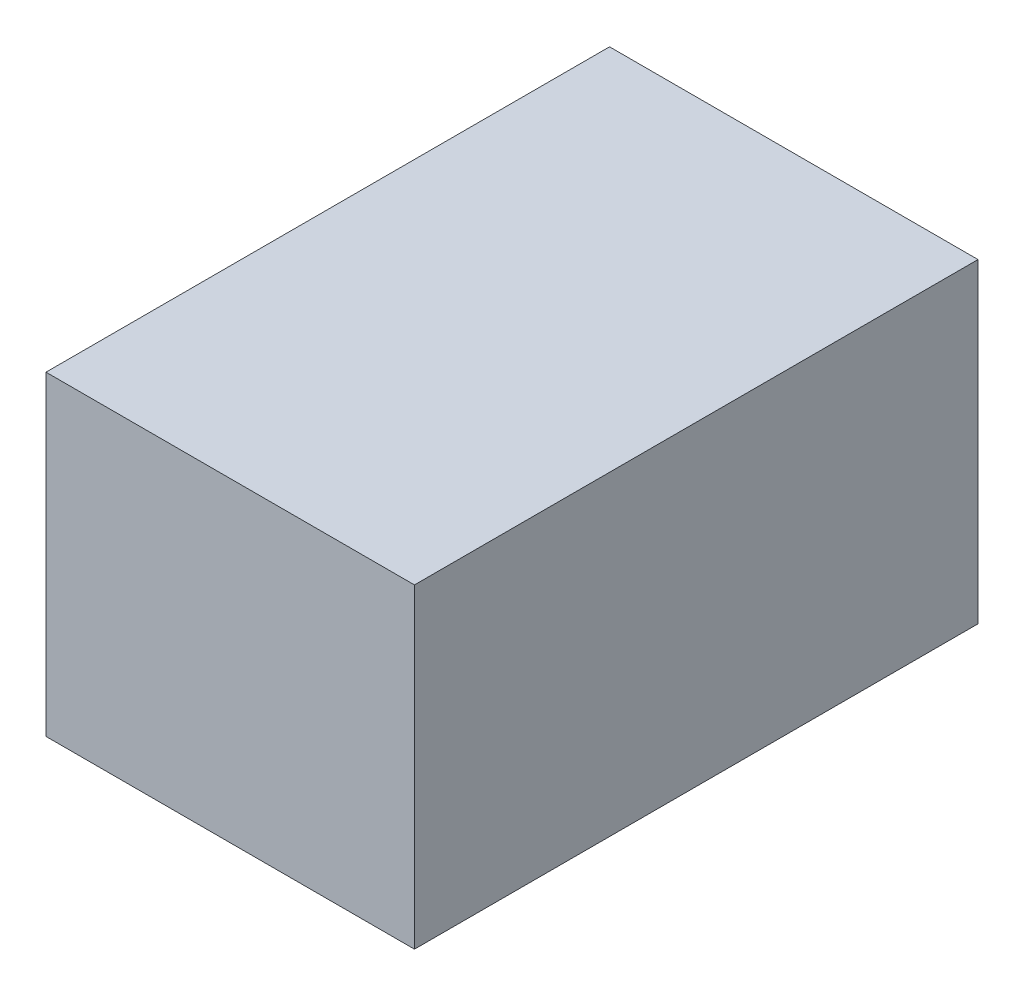
ISO-10303-21;
HEADER;
FILE_DESCRIPTION(('STEP AP214'),'2;1');
FILE_NAME('part.step','',(''),(''),'','','');
FILE_SCHEMA(('AUTOMOTIVE_DESIGN { 1 0 10303 214 1 1 1 1 }'));
ENDSEC;
DATA;
#1=APPLICATION_CONTEXT('core data for automotive mechanical design processes');
#2=APPLICATION_PROTOCOL_DEFINITION('international standard','automotive_design',2000,#1);
#3=PRODUCT_CONTEXT('',#1,'mechanical');
#4=PRODUCT('Part','Part','',(#3));
#5=PRODUCT_RELATED_PRODUCT_CATEGORY('part','',(#4));
#6=PRODUCT_DEFINITION_FORMATION('','',#4);
#7=PRODUCT_DEFINITION_CONTEXT('part definition',#1,'design');
#8=PRODUCT_DEFINITION('design','',#6,#7);
#9=PRODUCT_DEFINITION_SHAPE('','',#8);
#10=(LENGTH_UNIT() NAMED_UNIT(*) SI_UNIT(.MILLI.,.METRE.));
#11=(NAMED_UNIT(*) PLANE_ANGLE_UNIT() SI_UNIT($,.RADIAN.));
#12=(NAMED_UNIT(*) SI_UNIT($,.STERADIAN.) SOLID_ANGLE_UNIT());
#13=UNCERTAINTY_MEASURE_WITH_UNIT(LENGTH_MEASURE(1.E-05),#10,'distance_accuracy_value','');
#14=(GEOMETRIC_REPRESENTATION_CONTEXT(3) GLOBAL_UNCERTAINTY_ASSIGNED_CONTEXT((#13)) GLOBAL_UNIT_ASSIGNED_CONTEXT((#10,
#11,#12)) REPRESENTATION_CONTEXT('',''));
#15=CARTESIAN_POINT('',(0.,0.,0.));
#16=DIRECTION('',(0.,0.,1.));
#17=DIRECTION('',(1.,0.,0.));
#18=AXIS2_PLACEMENT_3D('',#15,#16,#17);
#19=CARTESIAN_POINT('',(-1470.24550898204,65.5,349.568862275449));
#20=DIRECTION('',(1.,0.,0.));
#21=DIRECTION('',(0.,0.,-1.));
#22=AXIS2_PLACEMENT_3D('',#19,#20,#21);
#23=PLANE('',#22);
#24=DIRECTION('',(0.,0.,1.));
#25=VECTOR('',#24,1.);
#26=CARTESIAN_POINT('',(-1470.24550898204,0.,349.568862275449));
#27=LINE('',#26,#25);
#28=CARTESIAN_POINT('',(-1470.24550898204,0.,232.568862275449));
#29=VERTEX_POINT('',#28);
#30=CARTESIAN_POINT('',(-1470.24550898204,0.,349.568862275449));
#31=VERTEX_POINT('',#30);
#32=EDGE_CURVE('E107',#29,#31,#27,.T.);
#33=ORIENTED_EDGE('',*,*,#32,.T.);
#34=DIRECTION('',(0.,-1.,0.));
#35=VECTOR('',#34,1.);
#36=CARTESIAN_POINT('',(-1470.24550898204,65.5,349.568862275449));
#37=LINE('',#36,#35);
#38=CARTESIAN_POINT('',(-1470.24550898204,65.5,349.568862275449));
#39=VERTEX_POINT('',#38);
#40=EDGE_CURVE('E11',#39,#31,#37,.T.);
#41=ORIENTED_EDGE('',*,*,#40,.F.);
#42=DIRECTION('',(0.,0.,1.));
#43=VECTOR('',#42,1.);
#44=CARTESIAN_POINT('',(-1470.24550898204,65.5,349.568862275449));
#45=LINE('',#44,#43);
#46=CARTESIAN_POINT('',(-1470.24550898204,65.5,232.568862275449));
#47=VERTEX_POINT('',#46);
#48=EDGE_CURVE('E91',#47,#39,#45,.T.);
#49=ORIENTED_EDGE('',*,*,#48,.F.);
#50=DIRECTION('',(0.,-1.,0.));
#51=VECTOR('',#50,1.);
#52=CARTESIAN_POINT('',(-1470.24550898204,65.5,232.568862275449));
#53=LINE('',#52,#51);
#54=EDGE_CURVE('E103',#47,#29,#53,.T.);
#55=ORIENTED_EDGE('',*,*,#54,.T.);
#56=EDGE_LOOP('',(#33,#41,#49,#55));
#57=FACE_BOUND('',#56,.T.);
#58=ADVANCED_FACE('F39',(#57),#23,.F.);
#59=CARTESIAN_POINT('',(-1470.24550898204,65.5,349.568862275449));
#60=DIRECTION('',(0.,0.,-1.));
#61=DIRECTION('',(-1.,0.,0.));
#62=AXIS2_PLACEMENT_3D('',#59,#60,#61);
#63=PLANE('',#62);
#64=DIRECTION('',(1.,0.,0.));
#65=VECTOR('',#64,1.);
#66=CARTESIAN_POINT('',(-1470.24550898204,0.,349.568862275449));
#67=LINE('',#66,#65);
#68=CARTESIAN_POINT('',(-1393.74550898204,0.,349.568862275449));
#69=VERTEX_POINT('',#68);
#70=EDGE_CURVE('E96',#31,#69,#67,.T.);
#71=ORIENTED_EDGE('',*,*,#70,.T.);
#72=DIRECTION('',(0.,-1.,0.));
#73=VECTOR('',#72,1.);
#74=CARTESIAN_POINT('',(-1393.74550898204,65.5,349.568862275449));
#75=LINE('',#74,#73);
#76=CARTESIAN_POINT('',(-1393.74550898204,65.5,349.568862275449));
#77=VERTEX_POINT('',#76);
#78=EDGE_CURVE('E48',#77,#69,#75,.T.);
#79=ORIENTED_EDGE('',*,*,#78,.F.);
#80=DIRECTION('',(1.,0.,0.));
#81=VECTOR('',#80,1.);
#82=CARTESIAN_POINT('',(-1470.24550898204,65.5,349.568862275449));
#83=LINE('',#82,#81);
#84=EDGE_CURVE('E86',#39,#77,#83,.T.);
#85=ORIENTED_EDGE('',*,*,#84,.F.);
#86=ORIENTED_EDGE('',*,*,#40,.T.);
#87=EDGE_LOOP('',(#71,#79,#85,#86));
#88=FACE_BOUND('',#87,.T.);
#89=ADVANCED_FACE('F95',(#88),#63,.F.);
#90=CARTESIAN_POINT('',(-1393.74550898204,65.5,349.568862275449));
#91=DIRECTION('',(-1.,0.,0.));
#92=DIRECTION('',(0.,0.,1.));
#93=AXIS2_PLACEMENT_3D('',#90,#91,#92);
#94=PLANE('',#93);
#95=DIRECTION('',(0.,0.,-1.));
#96=VECTOR('',#95,1.);
#97=CARTESIAN_POINT('',(-1393.74550898204,0.,349.568862275449));
#98=LINE('',#97,#96);
#99=CARTESIAN_POINT('',(-1393.74550898204,0.,232.568862275449));
#100=VERTEX_POINT('',#99);
#101=EDGE_CURVE('E73',#69,#100,#98,.T.);
#102=ORIENTED_EDGE('',*,*,#101,.T.);
#103=DIRECTION('',(0.,-1.,0.));
#104=VECTOR('',#103,1.);
#105=CARTESIAN_POINT('',(-1393.74550898204,65.5,232.568862275449));
#106=LINE('',#105,#104);
#107=CARTESIAN_POINT('',(-1393.74550898204,65.5,232.568862275449));
#108=VERTEX_POINT('',#107);
#109=EDGE_CURVE('E98',#108,#100,#106,.T.);
#110=ORIENTED_EDGE('',*,*,#109,.F.);
#111=DIRECTION('',(0.,0.,-1.));
#112=VECTOR('',#111,1.);
#113=CARTESIAN_POINT('',(-1393.74550898204,65.5,349.568862275449));
#114=LINE('',#113,#112);
#115=EDGE_CURVE('E89',#77,#108,#114,.T.);
#116=ORIENTED_EDGE('',*,*,#115,.F.);
#117=ORIENTED_EDGE('',*,*,#78,.T.);
#118=EDGE_LOOP('',(#102,#110,#116,#117));
#119=FACE_BOUND('',#118,.T.);
#120=ADVANCED_FACE('F99',(#119),#94,.F.);
#121=CARTESIAN_POINT('',(-1470.24550898204,65.5,232.568862275449));
#122=DIRECTION('',(0.,0.,1.));
#123=DIRECTION('',(1.,0.,0.));
#124=AXIS2_PLACEMENT_3D('',#121,#122,#123);
#125=PLANE('',#124);
#126=DIRECTION('',(-1.,0.,0.));
#127=VECTOR('',#126,1.);
#128=CARTESIAN_POINT('',(-1470.24550898204,0.,232.568862275449));
#129=LINE('',#128,#127);
#130=EDGE_CURVE('E79',#100,#29,#129,.T.);
#131=ORIENTED_EDGE('',*,*,#130,.T.);
#132=ORIENTED_EDGE('',*,*,#54,.F.);
#133=DIRECTION('',(-1.,0.,0.));
#134=VECTOR('',#133,1.);
#135=CARTESIAN_POINT('',(-1470.24550898204,65.5,232.568862275449));
#136=LINE('',#135,#134);
#137=EDGE_CURVE('E56',#108,#47,#136,.T.);
#138=ORIENTED_EDGE('',*,*,#137,.F.);
#139=ORIENTED_EDGE('',*,*,#109,.T.);
#140=EDGE_LOOP('',(#131,#132,#138,#139));
#141=FACE_BOUND('',#140,.T.);
#142=ADVANCED_FACE('F120',(#141),#125,.F.);
#143=CARTESIAN_POINT('',(0.,65.5,0.));
#144=DIRECTION('',(0.,-1.,0.));
#145=DIRECTION('',(0.,0.,-1.));
#146=AXIS2_PLACEMENT_3D('',#143,#144,#145);
#147=PLANE('',#146);
#148=ORIENTED_EDGE('',*,*,#48,.T.);
#149=ORIENTED_EDGE('',*,*,#84,.T.);
#150=ORIENTED_EDGE('',*,*,#115,.T.);
#151=ORIENTED_EDGE('',*,*,#137,.T.);
#152=EDGE_LOOP('',(#148,#149,#150,#151));
#153=FACE_BOUND('',#152,.T.);
#154=ADVANCED_FACE('F87',(#153),#147,.F.);
#155=CARTESIAN_POINT('',(0.,0.,0.));
#156=DIRECTION('',(0.,-1.,0.));
#157=DIRECTION('',(0.,0.,-1.));
#158=AXIS2_PLACEMENT_3D('',#155,#156,#157);
#159=PLANE('',#158);
#160=ORIENTED_EDGE('',*,*,#32,.F.);
#161=ORIENTED_EDGE('',*,*,#130,.F.);
#162=ORIENTED_EDGE('',*,*,#101,.F.);
#163=ORIENTED_EDGE('',*,*,#70,.F.);
#164=EDGE_LOOP('',(#160,#161,#162,#163));
#165=FACE_BOUND('',#164,.T.);
#166=ADVANCED_FACE('F123',(#165),#159,.T.);
#167=CLOSED_SHELL('',(#58,#89,#120,#142,#154,#166));
#168=MANIFOLD_SOLID_BREP('B2',#167);
#169=ADVANCED_BREP_SHAPE_REPRESENTATION('',(#18,#168),#14);
#170=SHAPE_DEFINITION_REPRESENTATION(#9,#169);
ENDSEC;
END-ISO-10303-21;
